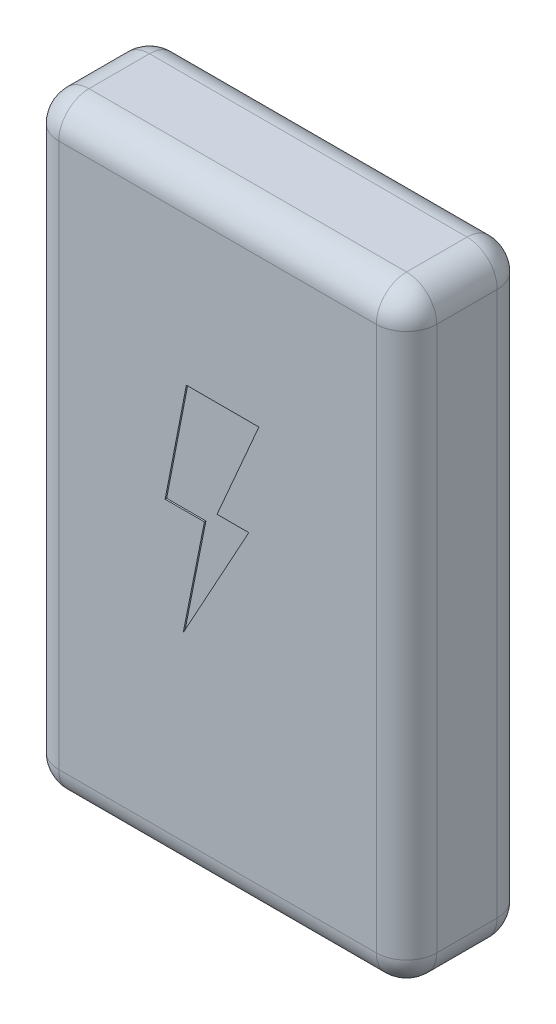
ISO-10303-21;
HEADER;
FILE_DESCRIPTION(('STEP AP214'),'2;1');
FILE_NAME('part.step','',(''),(''),'','','');
FILE_SCHEMA(('AUTOMOTIVE_DESIGN { 1 0 10303 214 1 1 1 1 }'));
ENDSEC;
DATA;
#1=APPLICATION_CONTEXT('core data for automotive mechanical design processes');
#2=APPLICATION_PROTOCOL_DEFINITION('international standard','automotive_design',2000,#1);
#3=PRODUCT_CONTEXT('',#1,'mechanical');
#4=PRODUCT('Part','Part','',(#3));
#5=PRODUCT_RELATED_PRODUCT_CATEGORY('part','',(#4));
#6=PRODUCT_DEFINITION_FORMATION('','',#4);
#7=PRODUCT_DEFINITION_CONTEXT('part definition',#1,'design');
#8=PRODUCT_DEFINITION('design','',#6,#7);
#9=PRODUCT_DEFINITION_SHAPE('','',#8);
#10=(LENGTH_UNIT() NAMED_UNIT(*) SI_UNIT(.MILLI.,.METRE.));
#11=(NAMED_UNIT(*) PLANE_ANGLE_UNIT() SI_UNIT($,.RADIAN.));
#12=(NAMED_UNIT(*) SI_UNIT($,.STERADIAN.) SOLID_ANGLE_UNIT());
#13=UNCERTAINTY_MEASURE_WITH_UNIT(LENGTH_MEASURE(1.E-05),#10,'distance_accuracy_value','');
#14=(GEOMETRIC_REPRESENTATION_CONTEXT(3) GLOBAL_UNCERTAINTY_ASSIGNED_CONTEXT((#13)) GLOBAL_UNIT_ASSIGNED_CONTEXT((#10,
#11,#12)) REPRESENTATION_CONTEXT('',''));
#15=CARTESIAN_POINT('',(0.,0.,0.));
#16=DIRECTION('',(0.,0.,1.));
#17=DIRECTION('',(1.,0.,0.));
#18=AXIS2_PLACEMENT_3D('',#15,#16,#17);
#19=CARTESIAN_POINT('',(12.5,-20.,8.));
#20=DIRECTION('',(-1.,0.,0.));
#21=DIRECTION('',(0.,0.,1.));
#22=AXIS2_PLACEMENT_3D('',#19,#20,#21);
#23=PLANE('',#22);
#24=DIRECTION('',(0.,1.,0.));
#25=VECTOR('',#24,1.);
#26=CARTESIAN_POINT('',(12.5,-20.,6.));
#27=LINE('',#26,#25);
#28=CARTESIAN_POINT('',(12.5,18.,6.));
#29=VERTEX_POINT('',#28);
#30=CARTESIAN_POINT('',(12.5,-18.,6.));
#31=VERTEX_POINT('',#30);
#32=EDGE_CURVE('E232',#29,#31,#27,.F.);
#33=ORIENTED_EDGE('',*,*,#32,.T.);
#34=DIRECTION('',(0.,0.,-1.));
#35=VECTOR('',#34,1.);
#36=CARTESIAN_POINT('',(12.5,-18.,8.));
#37=LINE('',#36,#35);
#38=CARTESIAN_POINT('',(12.5,-18.,2.));
#39=VERTEX_POINT('',#38);
#40=EDGE_CURVE('E237',#31,#39,#37,.T.);
#41=ORIENTED_EDGE('',*,*,#40,.T.);
#42=DIRECTION('',(0.,1.,0.));
#43=VECTOR('',#42,1.);
#44=CARTESIAN_POINT('',(12.5,20.,2.));
#45=LINE('',#44,#43);
#46=CARTESIAN_POINT('',(12.5,18.,2.));
#47=VERTEX_POINT('',#46);
#48=EDGE_CURVE('E234',#39,#47,#45,.T.);
#49=ORIENTED_EDGE('',*,*,#48,.T.);
#50=DIRECTION('',(0.,0.,-1.));
#51=VECTOR('',#50,1.);
#52=CARTESIAN_POINT('',(12.5,18.,8.));
#53=LINE('',#52,#51);
#54=EDGE_CURVE('E230',#47,#29,#53,.F.);
#55=ORIENTED_EDGE('',*,*,#54,.T.);
#56=EDGE_LOOP('',(#33,#41,#49,#55));
#57=FACE_BOUND('',#56,.T.);
#58=ADVANCED_FACE('F35',(#57),#23,.F.);
#59=CARTESIAN_POINT('',(-12.5,20.,8.));
#60=DIRECTION('',(0.,-1.,0.));
#61=DIRECTION('',(0.,0.,-1.));
#62=AXIS2_PLACEMENT_3D('',#59,#60,#61);
#63=PLANE('',#62);
#64=DIRECTION('',(-1.,0.,0.));
#65=VECTOR('',#64,1.);
#66=CARTESIAN_POINT('',(-12.5,20.,6.));
#67=LINE('',#66,#65);
#68=CARTESIAN_POINT('',(-10.5,20.,6.));
#69=VERTEX_POINT('',#68);
#70=CARTESIAN_POINT('',(10.5,20.,6.));
#71=VERTEX_POINT('',#70);
#72=EDGE_CURVE('E44',#69,#71,#67,.F.);
#73=ORIENTED_EDGE('',*,*,#72,.T.);
#74=DIRECTION('',(0.,0.,-1.));
#75=VECTOR('',#74,1.);
#76=CARTESIAN_POINT('',(10.5,20.,8.));
#77=LINE('',#76,#75);
#78=CARTESIAN_POINT('',(10.5,20.,2.));
#79=VERTEX_POINT('',#78);
#80=EDGE_CURVE('E11',#71,#79,#77,.T.);
#81=ORIENTED_EDGE('',*,*,#80,.T.);
#82=DIRECTION('',(-1.,0.,0.));
#83=VECTOR('',#82,1.);
#84=CARTESIAN_POINT('',(-12.5,20.,2.));
#85=LINE('',#84,#83);
#86=CARTESIAN_POINT('',(-10.5,20.,2.));
#87=VERTEX_POINT('',#86);
#88=EDGE_CURVE('E275',#79,#87,#85,.T.);
#89=ORIENTED_EDGE('',*,*,#88,.T.);
#90=DIRECTION('',(0.,0.,-1.));
#91=VECTOR('',#90,1.);
#92=CARTESIAN_POINT('',(-10.5,20.,8.));
#93=LINE('',#92,#91);
#94=EDGE_CURVE('E277',#87,#69,#93,.F.);
#95=ORIENTED_EDGE('',*,*,#94,.T.);
#96=EDGE_LOOP('',(#73,#81,#89,#95));
#97=FACE_BOUND('',#96,.T.);
#98=ADVANCED_FACE('F432',(#97),#63,.F.);
#99=CARTESIAN_POINT('',(-12.5,-20.,8.));
#100=DIRECTION('',(1.,0.,0.));
#101=DIRECTION('',(0.,0.,-1.));
#102=AXIS2_PLACEMENT_3D('',#99,#100,#101);
#103=PLANE('',#102);
#104=DIRECTION('',(0.,-1.,0.));
#105=VECTOR('',#104,1.);
#106=CARTESIAN_POINT('',(-12.5,-20.,2.));
#107=LINE('',#106,#105);
#108=CARTESIAN_POINT('',(-12.5,18.,2.));
#109=VERTEX_POINT('',#108);
#110=CARTESIAN_POINT('',(-12.5,-18.,2.));
#111=VERTEX_POINT('',#110);
#112=EDGE_CURVE('E259',#109,#111,#107,.T.);
#113=ORIENTED_EDGE('',*,*,#112,.T.);
#114=DIRECTION('',(0.,0.,-1.));
#115=VECTOR('',#114,1.);
#116=CARTESIAN_POINT('',(-12.5,-18.,8.));
#117=LINE('',#116,#115);
#118=CARTESIAN_POINT('',(-12.5,-18.,6.));
#119=VERTEX_POINT('',#118);
#120=EDGE_CURVE('E264',#111,#119,#117,.F.);
#121=ORIENTED_EDGE('',*,*,#120,.T.);
#122=DIRECTION('',(0.,-1.,0.));
#123=VECTOR('',#122,1.);
#124=CARTESIAN_POINT('',(-12.5,-20.,6.));
#125=LINE('',#124,#123);
#126=CARTESIAN_POINT('',(-12.5,18.,6.));
#127=VERTEX_POINT('',#126);
#128=EDGE_CURVE('E261',#119,#127,#125,.F.);
#129=ORIENTED_EDGE('',*,*,#128,.T.);
#130=DIRECTION('',(0.,0.,-1.));
#131=VECTOR('',#130,1.);
#132=CARTESIAN_POINT('',(-12.5,18.,8.));
#133=LINE('',#132,#131);
#134=EDGE_CURVE('E257',#127,#109,#133,.T.);
#135=ORIENTED_EDGE('',*,*,#134,.T.);
#136=EDGE_LOOP('',(#113,#121,#129,#135));
#137=FACE_BOUND('',#136,.T.);
#138=ADVANCED_FACE('F384',(#137),#103,.F.);
#139=CARTESIAN_POINT('',(-12.5,-20.,8.));
#140=DIRECTION('',(0.,1.,0.));
#141=DIRECTION('',(0.,0.,1.));
#142=AXIS2_PLACEMENT_3D('',#139,#140,#141);
#143=PLANE('',#142);
#144=DIRECTION('',(1.,0.,0.));
#145=VECTOR('',#144,1.);
#146=CARTESIAN_POINT('',(-12.5,-20.,6.));
#147=LINE('',#146,#145);
#148=CARTESIAN_POINT('',(10.5,-20.,6.));
#149=VERTEX_POINT('',#148);
#150=CARTESIAN_POINT('',(-10.5,-20.,6.));
#151=VERTEX_POINT('',#150);
#152=EDGE_CURVE('E270',#149,#151,#147,.F.);
#153=ORIENTED_EDGE('',*,*,#152,.T.);
#154=DIRECTION('',(0.,0.,-1.));
#155=VECTOR('',#154,1.);
#156=CARTESIAN_POINT('',(-10.5,-20.,8.));
#157=LINE('',#156,#155);
#158=CARTESIAN_POINT('',(-10.5,-20.,2.));
#159=VERTEX_POINT('',#158);
#160=EDGE_CURVE('E272',#151,#159,#157,.T.);
#161=ORIENTED_EDGE('',*,*,#160,.T.);
#162=DIRECTION('',(1.,0.,0.));
#163=VECTOR('',#162,1.);
#164=CARTESIAN_POINT('',(12.5,-20.,2.));
#165=LINE('',#164,#163);
#166=CARTESIAN_POINT('',(10.5,-20.,2.));
#167=VERTEX_POINT('',#166);
#168=EDGE_CURVE('E266',#159,#167,#165,.T.);
#169=ORIENTED_EDGE('',*,*,#168,.T.);
#170=DIRECTION('',(0.,0.,-1.));
#171=VECTOR('',#170,1.);
#172=CARTESIAN_POINT('',(10.5,-20.,8.));
#173=LINE('',#172,#171);
#174=EDGE_CURVE('E268',#167,#149,#173,.F.);
#175=ORIENTED_EDGE('',*,*,#174,.T.);
#176=EDGE_LOOP('',(#153,#161,#169,#175));
#177=FACE_BOUND('',#176,.T.);
#178=ADVANCED_FACE('F363',(#177),#143,.F.);
#179=CARTESIAN_POINT('',(0.,0.,8.));
#180=DIRECTION('',(0.,0.,-1.));
#181=DIRECTION('',(-1.,0.,0.));
#182=AXIS2_PLACEMENT_3D('',#179,#180,#181);
#183=PLANE('',#182);
#184=DIRECTION('',(1.,0.,0.));
#185=VECTOR('',#184,1.);
#186=CARTESIAN_POINT('',(-0.867604628289784,1.00308288129449,8.));
#187=LINE('',#186,#185);
#188=CARTESIAN_POINT('',(-3.46430276113144,1.00308288129449,8.));
#189=VERTEX_POINT('',#188);
#190=CARTESIAN_POINT('',(-0.867604628289784,1.00308288129449,8.));
#191=VERTEX_POINT('',#190);
#192=EDGE_CURVE('E205',#189,#191,#187,.T.);
#193=ORIENTED_EDGE('',*,*,#192,.F.);
#194=DIRECTION('',(-0.190425341389638,-0.981701680428754,0.));
#195=VECTOR('',#194,1.);
#196=CARTESIAN_POINT('',(-3.46430276113144,1.00308288129449,8.));
#197=LINE('',#196,#195);
#198=CARTESIAN_POINT('',(-2.06102047070228,8.23743820699371,8.));
#199=VERTEX_POINT('',#198);
#200=EDGE_CURVE('E52',#199,#189,#197,.T.);
#201=ORIENTED_EDGE('',*,*,#200,.F.);
#202=DIRECTION('',(-1.,0.,0.));
#203=VECTOR('',#202,1.);
#204=CARTESIAN_POINT('',(-2.06102047070228,8.23743820699371,8.));
#205=LINE('',#204,#203);
#206=CARTESIAN_POINT('',(2.73657323232504,8.23743820699371,8.));
#207=VERTEX_POINT('',#206);
#208=EDGE_CURVE('E188',#207,#199,#205,.T.);
#209=ORIENTED_EDGE('',*,*,#208,.F.);
#210=DIRECTION('',(0.397890513057752,0.917432907420831,0.));
#211=VECTOR('',#210,1.);
#212=CARTESIAN_POINT('',(2.73657323232504,8.23743820699371,8.));
#213=LINE('',#212,#211);
#214=CARTESIAN_POINT('',(-0.0318433643303729,1.85418350784734,8.));
#215=VERTEX_POINT('',#214);
#216=EDGE_CURVE('E191',#215,#207,#213,.T.);
#217=ORIENTED_EDGE('',*,*,#216,.F.);
#218=DIRECTION('',(-1.,0.,0.));
#219=VECTOR('',#218,1.);
#220=CARTESIAN_POINT('',(-0.0318433643303729,1.85418350784734,8.));
#221=LINE('',#220,#219);
#222=CARTESIAN_POINT('',(2.06818064833672,1.85418350784734,8.));
#223=VERTEX_POINT('',#222);
#224=EDGE_CURVE('E213',#223,#215,#221,.T.);
#225=ORIENTED_EDGE('',*,*,#224,.F.);
#226=DIRECTION('',(0.481485492555053,0.876454060666626,0.));
#227=VECTOR('',#226,1.);
#228=CARTESIAN_POINT('',(2.06818064833672,1.85418350784734,8.));
#229=LINE('',#228,#227);
#230=CARTESIAN_POINT('',(-2.26838238290328,-6.03971638495679,8.));
#231=VERTEX_POINT('',#230);
#232=EDGE_CURVE('E210',#231,#223,#229,.T.);
#233=ORIENTED_EDGE('',*,*,#232,.F.);
#234=DIRECTION('',(-0.195073962632189,-0.980788534345185,0.));
#235=VECTOR('',#234,1.);
#236=CARTESIAN_POINT('',(-2.26838238290328,-6.03971638495679,8.));
#237=LINE('',#236,#235);
#238=EDGE_CURVE('E207',#191,#231,#237,.T.);
#239=ORIENTED_EDGE('',*,*,#238,.F.);
#240=EDGE_LOOP('',(#193,#201,#209,#217,#225,#233,#239));
#241=FACE_BOUND('',#240,.T.);
#242=DIRECTION('',(0.,-1.,0.));
#243=VECTOR('',#242,1.);
#244=CARTESIAN_POINT('',(-10.5,0.,8.));
#245=LINE('',#244,#243);
#246=CARTESIAN_POINT('',(-10.5,18.,8.));
#247=VERTEX_POINT('',#246);
#248=CARTESIAN_POINT('',(-10.5,-18.,8.));
#249=VERTEX_POINT('',#248);
#250=EDGE_CURVE('E250',#247,#249,#245,.T.);
#251=ORIENTED_EDGE('',*,*,#250,.T.);
#252=DIRECTION('',(1.,0.,0.));
#253=VECTOR('',#252,1.);
#254=CARTESIAN_POINT('',(0.,-18.,8.));
#255=LINE('',#254,#253);
#256=CARTESIAN_POINT('',(10.5,-18.,8.));
#257=VERTEX_POINT('',#256);
#258=EDGE_CURVE('E255',#249,#257,#255,.T.);
#259=ORIENTED_EDGE('',*,*,#258,.T.);
#260=DIRECTION('',(0.,1.,0.));
#261=VECTOR('',#260,1.);
#262=CARTESIAN_POINT('',(10.5,0.,8.));
#263=LINE('',#262,#261);
#264=CARTESIAN_POINT('',(10.5,18.,8.));
#265=VERTEX_POINT('',#264);
#266=EDGE_CURVE('E252',#257,#265,#263,.T.);
#267=ORIENTED_EDGE('',*,*,#266,.T.);
#268=DIRECTION('',(-1.,0.,0.));
#269=VECTOR('',#268,1.);
#270=CARTESIAN_POINT('',(0.,18.,8.));
#271=LINE('',#270,#269);
#272=EDGE_CURVE('E248',#265,#247,#271,.T.);
#273=ORIENTED_EDGE('',*,*,#272,.T.);
#274=EDGE_LOOP('',(#251,#259,#267,#273));
#275=FACE_BOUND('',#274,.T.);
#276=ADVANCED_FACE('F371',(#241,#275),#183,.F.);
#277=CARTESIAN_POINT('',(0.,0.,0.));
#278=DIRECTION('',(0.,0.,-1.));
#279=DIRECTION('',(-1.,0.,0.));
#280=AXIS2_PLACEMENT_3D('',#277,#278,#279);
#281=PLANE('',#280);
#282=DIRECTION('',(0.,1.,0.));
#283=VECTOR('',#282,1.);
#284=CARTESIAN_POINT('',(10.5,-20.,0.));
#285=LINE('',#284,#283);
#286=CARTESIAN_POINT('',(10.5,18.,0.));
#287=VERTEX_POINT('',#286);
#288=CARTESIAN_POINT('',(10.5,-18.,0.));
#289=VERTEX_POINT('',#288);
#290=EDGE_CURVE('E243',#287,#289,#285,.F.);
#291=ORIENTED_EDGE('',*,*,#290,.T.);
#292=DIRECTION('',(1.,0.,0.));
#293=VECTOR('',#292,1.);
#294=CARTESIAN_POINT('',(-12.5,-18.,0.));
#295=LINE('',#294,#293);
#296=CARTESIAN_POINT('',(-10.5,-18.,0.));
#297=VERTEX_POINT('',#296);
#298=EDGE_CURVE('E246',#289,#297,#295,.F.);
#299=ORIENTED_EDGE('',*,*,#298,.T.);
#300=DIRECTION('',(0.,-1.,0.));
#301=VECTOR('',#300,1.);
#302=CARTESIAN_POINT('',(-10.5,20.,0.));
#303=LINE('',#302,#301);
#304=CARTESIAN_POINT('',(-10.5,18.,0.));
#305=VERTEX_POINT('',#304);
#306=EDGE_CURVE('E241',#297,#305,#303,.F.);
#307=ORIENTED_EDGE('',*,*,#306,.T.);
#308=DIRECTION('',(-1.,0.,0.));
#309=VECTOR('',#308,1.);
#310=CARTESIAN_POINT('',(12.5,18.,0.));
#311=LINE('',#310,#309);
#312=EDGE_CURVE('E239',#305,#287,#311,.F.);
#313=ORIENTED_EDGE('',*,*,#312,.T.);
#314=EDGE_LOOP('',(#291,#299,#307,#313));
#315=FACE_BOUND('',#314,.T.);
#316=ADVANCED_FACE('F404',(#315),#281,.T.);
#317=CARTESIAN_POINT('',(-10.5,0.,6.));
#318=DIRECTION('',(0.,-1.,0.));
#319=DIRECTION('',(0.,0.,-1.));
#320=AXIS2_PLACEMENT_3D('',#317,#318,#319);
#321=CYLINDRICAL_SURFACE('',#320,2.);
#322=CARTESIAN_POINT('',(-10.5,-18.,6.));
#323=DIRECTION('',(0.,-1.,0.));
#324=DIRECTION('',(0.,0.,-1.));
#325=AXIS2_PLACEMENT_3D('',#322,#323,#324);
#326=CIRCLE('',#325,2.);
#327=EDGE_CURVE('E39',#249,#119,#326,.T.);
#328=ORIENTED_EDGE('',*,*,#327,.F.);
#329=ORIENTED_EDGE('',*,*,#250,.F.);
#330=CARTESIAN_POINT('',(-10.5,18.,6.));
#331=DIRECTION('',(0.,1.,0.));
#332=DIRECTION('',(0.,0.,1.));
#333=AXIS2_PLACEMENT_3D('',#330,#331,#332);
#334=CIRCLE('',#333,2.);
#335=EDGE_CURVE('E340',#127,#247,#334,.T.);
#336=ORIENTED_EDGE('',*,*,#335,.F.);
#337=ORIENTED_EDGE('',*,*,#128,.F.);
#338=EDGE_LOOP('',(#328,#329,#336,#337));
#339=FACE_BOUND('',#338,.T.);
#340=ADVANCED_FACE('F37',(#339),#321,.T.);
#341=CARTESIAN_POINT('',(-10.5,-18.,6.));
#342=DIRECTION('',(0.,0.,1.));
#343=DIRECTION('',(1.,0.,0.));
#344=AXIS2_PLACEMENT_3D('',#341,#342,#343);
#345=SPHERICAL_SURFACE('',#344,2.);
#346=CARTESIAN_POINT('',(-10.5,-18.,6.));
#347=DIRECTION('',(-1.,0.,0.));
#348=DIRECTION('',(0.,0.,1.));
#349=AXIS2_PLACEMENT_3D('',#346,#347,#348);
#350=CIRCLE('',#349,2.);
#351=EDGE_CURVE('E335',#249,#151,#350,.F.);
#352=ORIENTED_EDGE('',*,*,#351,.F.);
#353=ORIENTED_EDGE('',*,*,#327,.T.);
#354=CARTESIAN_POINT('',(-10.5,-18.,6.));
#355=DIRECTION('',(0.,0.,1.));
#356=DIRECTION('',(1.,0.,0.));
#357=AXIS2_PLACEMENT_3D('',#354,#355,#356);
#358=CIRCLE('',#357,2.);
#359=EDGE_CURVE('E338',#151,#119,#358,.F.);
#360=ORIENTED_EDGE('',*,*,#359,.F.);
#361=EDGE_LOOP('',(#352,#353,#360));
#362=FACE_BOUND('',#361,.T.);
#363=ADVANCED_FACE('F351',(#362),#345,.T.);
#364=CARTESIAN_POINT('',(-10.5,18.,6.));
#365=DIRECTION('',(0.,0.,1.));
#366=DIRECTION('',(1.,0.,0.));
#367=AXIS2_PLACEMENT_3D('',#364,#365,#366);
#368=SPHERICAL_SURFACE('',#367,2.);
#369=CARTESIAN_POINT('',(-10.5,18.,6.));
#370=DIRECTION('',(0.,0.,1.));
#371=DIRECTION('',(1.,0.,0.));
#372=AXIS2_PLACEMENT_3D('',#369,#370,#371);
#373=CIRCLE('',#372,2.);
#374=EDGE_CURVE('E329',#127,#69,#373,.F.);
#375=ORIENTED_EDGE('',*,*,#374,.F.);
#376=ORIENTED_EDGE('',*,*,#335,.T.);
#377=CARTESIAN_POINT('',(-10.5,18.,6.));
#378=DIRECTION('',(-1.,0.,0.));
#379=DIRECTION('',(0.,0.,1.));
#380=AXIS2_PLACEMENT_3D('',#377,#378,#379);
#381=CIRCLE('',#380,2.);
#382=EDGE_CURVE('E332',#69,#247,#381,.F.);
#383=ORIENTED_EDGE('',*,*,#382,.F.);
#384=EDGE_LOOP('',(#375,#376,#383));
#385=FACE_BOUND('',#384,.T.);
#386=ADVANCED_FACE('F597',(#385),#368,.T.);
#387=CARTESIAN_POINT('',(-10.5,-18.,8.));
#388=DIRECTION('',(0.,0.,-1.));
#389=DIRECTION('',(-1.,0.,0.));
#390=AXIS2_PLACEMENT_3D('',#387,#388,#389);
#391=CYLINDRICAL_SURFACE('',#390,2.);
#392=ORIENTED_EDGE('',*,*,#359,.T.);
#393=ORIENTED_EDGE('',*,*,#120,.F.);
#394=CARTESIAN_POINT('',(-10.5,-18.,2.));
#395=DIRECTION('',(0.,0.,-1.));
#396=DIRECTION('',(-1.,0.,0.));
#397=AXIS2_PLACEMENT_3D('',#394,#395,#396);
#398=CIRCLE('',#397,2.);
#399=EDGE_CURVE('E323',#159,#111,#398,.T.);
#400=ORIENTED_EDGE('',*,*,#399,.F.);
#401=ORIENTED_EDGE('',*,*,#160,.F.);
#402=EDGE_LOOP('',(#392,#393,#400,#401));
#403=FACE_BOUND('',#402,.T.);
#404=ADVANCED_FACE('F359',(#403),#391,.T.);
#405=CARTESIAN_POINT('',(0.,-18.,6.));
#406=DIRECTION('',(1.,0.,0.));
#407=DIRECTION('',(0.,0.,-1.));
#408=AXIS2_PLACEMENT_3D('',#405,#406,#407);
#409=CYLINDRICAL_SURFACE('',#408,2.);
#410=ORIENTED_EDGE('',*,*,#351,.T.);
#411=ORIENTED_EDGE('',*,*,#152,.F.);
#412=CARTESIAN_POINT('',(10.5,-18.,6.));
#413=DIRECTION('',(1.,0.,0.));
#414=DIRECTION('',(0.,0.,-1.));
#415=AXIS2_PLACEMENT_3D('',#412,#413,#414);
#416=CIRCLE('',#415,2.);
#417=EDGE_CURVE('E320',#257,#149,#416,.T.);
#418=ORIENTED_EDGE('',*,*,#417,.F.);
#419=ORIENTED_EDGE('',*,*,#258,.F.);
#420=EDGE_LOOP('',(#410,#411,#418,#419));
#421=FACE_BOUND('',#420,.T.);
#422=ADVANCED_FACE('F368',(#421),#409,.T.);
#423=CARTESIAN_POINT('',(10.5,0.,6.));
#424=DIRECTION('',(0.,1.,0.));
#425=DIRECTION('',(0.,0.,1.));
#426=AXIS2_PLACEMENT_3D('',#423,#424,#425);
#427=CYLINDRICAL_SURFACE('',#426,2.);
#428=CARTESIAN_POINT('',(10.5,18.,6.));
#429=DIRECTION('',(0.,1.,0.));
#430=DIRECTION('',(0.,0.,1.));
#431=AXIS2_PLACEMENT_3D('',#428,#429,#430);
#432=CIRCLE('',#431,2.);
#433=EDGE_CURVE('E314',#265,#29,#432,.T.);
#434=ORIENTED_EDGE('',*,*,#433,.F.);
#435=ORIENTED_EDGE('',*,*,#266,.F.);
#436=CARTESIAN_POINT('',(10.5,-18.,6.));
#437=DIRECTION('',(0.,-1.,0.));
#438=DIRECTION('',(0.,0.,-1.));
#439=AXIS2_PLACEMENT_3D('',#436,#437,#438);
#440=CIRCLE('',#439,2.);
#441=EDGE_CURVE('E317',#31,#257,#440,.T.);
#442=ORIENTED_EDGE('',*,*,#441,.F.);
#443=ORIENTED_EDGE('',*,*,#32,.F.);
#444=EDGE_LOOP('',(#434,#435,#442,#443));
#445=FACE_BOUND('',#444,.T.);
#446=ADVANCED_FACE('F375',(#445),#427,.T.);
#447=CARTESIAN_POINT('',(0.,18.,6.));
#448=DIRECTION('',(-1.,0.,0.));
#449=DIRECTION('',(0.,0.,1.));
#450=AXIS2_PLACEMENT_3D('',#447,#448,#449);
#451=CYLINDRICAL_SURFACE('',#450,2.);
#452=ORIENTED_EDGE('',*,*,#382,.T.);
#453=ORIENTED_EDGE('',*,*,#272,.F.);
#454=CARTESIAN_POINT('',(10.5,18.,6.));
#455=DIRECTION('',(1.,0.,0.));
#456=DIRECTION('',(0.,0.,-1.));
#457=AXIS2_PLACEMENT_3D('',#454,#455,#456);
#458=CIRCLE('',#457,2.);
#459=EDGE_CURVE('E312',#71,#265,#458,.T.);
#460=ORIENTED_EDGE('',*,*,#459,.F.);
#461=ORIENTED_EDGE('',*,*,#72,.F.);
#462=EDGE_LOOP('',(#452,#453,#460,#461));
#463=FACE_BOUND('',#462,.T.);
#464=ADVANCED_FACE('F382',(#463),#451,.T.);
#465=CARTESIAN_POINT('',(-10.5,18.,8.));
#466=DIRECTION('',(0.,0.,-1.));
#467=DIRECTION('',(-1.,0.,0.));
#468=AXIS2_PLACEMENT_3D('',#465,#466,#467);
#469=CYLINDRICAL_SURFACE('',#468,2.);
#470=ORIENTED_EDGE('',*,*,#374,.T.);
#471=ORIENTED_EDGE('',*,*,#94,.F.);
#472=CARTESIAN_POINT('',(-10.5,18.,2.));
#473=DIRECTION('',(0.,0.,-1.));
#474=DIRECTION('',(-1.,0.,0.));
#475=AXIS2_PLACEMENT_3D('',#472,#473,#474);
#476=CIRCLE('',#475,2.);
#477=EDGE_CURVE('E309',#109,#87,#476,.T.);
#478=ORIENTED_EDGE('',*,*,#477,.F.);
#479=ORIENTED_EDGE('',*,*,#134,.F.);
#480=EDGE_LOOP('',(#470,#471,#478,#479));
#481=FACE_BOUND('',#480,.T.);
#482=ADVANCED_FACE('F394',(#481),#469,.T.);
#483=CARTESIAN_POINT('',(-10.5,-20.,2.));
#484=DIRECTION('',(0.,1.,0.));
#485=DIRECTION('',(0.,0.,1.));
#486=AXIS2_PLACEMENT_3D('',#483,#484,#485);
#487=CYLINDRICAL_SURFACE('',#486,2.);
#488=CARTESIAN_POINT('',(-10.5,-18.,2.));
#489=DIRECTION('',(0.,-1.,0.));
#490=DIRECTION('',(0.,0.,-1.));
#491=AXIS2_PLACEMENT_3D('',#488,#489,#490);
#492=CIRCLE('',#491,2.);
#493=EDGE_CURVE('E326',#111,#297,#492,.T.);
#494=ORIENTED_EDGE('',*,*,#493,.F.);
#495=ORIENTED_EDGE('',*,*,#112,.F.);
#496=CARTESIAN_POINT('',(-10.5,18.,2.));
#497=DIRECTION('',(0.,1.,0.));
#498=DIRECTION('',(-1.,0.,0.));
#499=AXIS2_PLACEMENT_3D('',#496,#497,#498);
#500=CIRCLE('',#499,2.);
#501=EDGE_CURVE('E306',#305,#109,#500,.T.);
#502=ORIENTED_EDGE('',*,*,#501,.F.);
#503=ORIENTED_EDGE('',*,*,#306,.F.);
#504=EDGE_LOOP('',(#494,#495,#502,#503));
#505=FACE_BOUND('',#504,.T.);
#506=ADVANCED_FACE('F389',(#505),#487,.T.);
#507=CARTESIAN_POINT('',(-10.5,-18.,2.));
#508=DIRECTION('',(0.,0.,1.));
#509=DIRECTION('',(1.,0.,0.));
#510=AXIS2_PLACEMENT_3D('',#507,#508,#509);
#511=SPHERICAL_SURFACE('',#510,2.);
#512=ORIENTED_EDGE('',*,*,#399,.T.);
#513=ORIENTED_EDGE('',*,*,#493,.T.);
#514=CARTESIAN_POINT('',(-10.5,-18.,2.));
#515=DIRECTION('',(-1.,0.,0.));
#516=DIRECTION('',(0.,0.,1.));
#517=AXIS2_PLACEMENT_3D('',#514,#515,#516);
#518=CIRCLE('',#517,2.);
#519=EDGE_CURVE('E303',#159,#297,#518,.F.);
#520=ORIENTED_EDGE('',*,*,#519,.F.);
#521=EDGE_LOOP('',(#512,#513,#520));
#522=FACE_BOUND('',#521,.T.);
#523=ADVANCED_FACE('F408',(#522),#511,.T.);
#524=CARTESIAN_POINT('',(10.5,-18.,6.));
#525=DIRECTION('',(0.,0.,1.));
#526=DIRECTION('',(1.,0.,0.));
#527=AXIS2_PLACEMENT_3D('',#524,#525,#526);
#528=SPHERICAL_SURFACE('',#527,2.);
#529=ORIENTED_EDGE('',*,*,#441,.T.);
#530=ORIENTED_EDGE('',*,*,#417,.T.);
#531=CARTESIAN_POINT('',(10.5,-18.,6.));
#532=DIRECTION('',(0.,0.,1.));
#533=DIRECTION('',(1.,0.,0.));
#534=AXIS2_PLACEMENT_3D('',#531,#532,#533);
#535=CIRCLE('',#534,2.);
#536=EDGE_CURVE('E300',#31,#149,#535,.F.);
#537=ORIENTED_EDGE('',*,*,#536,.F.);
#538=EDGE_LOOP('',(#529,#530,#537));
#539=FACE_BOUND('',#538,.T.);
#540=ADVANCED_FACE('F421',(#539),#528,.T.);
#541=CARTESIAN_POINT('',(10.5,18.,6.));
#542=DIRECTION('',(0.,0.,1.));
#543=DIRECTION('',(1.,0.,0.));
#544=AXIS2_PLACEMENT_3D('',#541,#542,#543);
#545=SPHERICAL_SURFACE('',#544,2.);
#546=ORIENTED_EDGE('',*,*,#459,.T.);
#547=ORIENTED_EDGE('',*,*,#433,.T.);
#548=CARTESIAN_POINT('',(10.5,18.,6.));
#549=DIRECTION('',(0.,0.,1.));
#550=DIRECTION('',(1.,0.,0.));
#551=AXIS2_PLACEMENT_3D('',#548,#549,#550);
#552=CIRCLE('',#551,2.);
#553=EDGE_CURVE('E297',#71,#29,#552,.F.);
#554=ORIENTED_EDGE('',*,*,#553,.F.);
#555=EDGE_LOOP('',(#546,#547,#554));
#556=FACE_BOUND('',#555,.T.);
#557=ADVANCED_FACE('F423',(#556),#545,.T.);
#558=CARTESIAN_POINT('',(-10.5,18.,2.));
#559=DIRECTION('',(0.,0.,1.));
#560=DIRECTION('',(1.,0.,0.));
#561=AXIS2_PLACEMENT_3D('',#558,#559,#560);
#562=SPHERICAL_SURFACE('',#561,2.);
#563=ORIENTED_EDGE('',*,*,#501,.T.);
#564=ORIENTED_EDGE('',*,*,#477,.T.);
#565=CARTESIAN_POINT('',(-10.5,18.,2.));
#566=DIRECTION('',(-1.,0.,0.));
#567=DIRECTION('',(0.,0.,1.));
#568=AXIS2_PLACEMENT_3D('',#565,#566,#567);
#569=CIRCLE('',#568,2.);
#570=EDGE_CURVE('E294',#305,#87,#569,.F.);
#571=ORIENTED_EDGE('',*,*,#570,.F.);
#572=EDGE_LOOP('',(#563,#564,#571));
#573=FACE_BOUND('',#572,.T.);
#574=ADVANCED_FACE('F396',(#573),#562,.T.);
#575=CARTESIAN_POINT('',(-12.5,-18.,2.));
#576=DIRECTION('',(-1.,0.,0.));
#577=DIRECTION('',(0.,0.,1.));
#578=AXIS2_PLACEMENT_3D('',#575,#576,#577);
#579=CYLINDRICAL_SURFACE('',#578,2.);
#580=ORIENTED_EDGE('',*,*,#519,.T.);
#581=ORIENTED_EDGE('',*,*,#298,.F.);
#582=CARTESIAN_POINT('',(10.5,-18.,2.));
#583=DIRECTION('',(1.,0.,0.));
#584=DIRECTION('',(0.,0.,-1.));
#585=AXIS2_PLACEMENT_3D('',#582,#583,#584);
#586=CIRCLE('',#585,2.);
#587=EDGE_CURVE('E291',#167,#289,#586,.T.);
#588=ORIENTED_EDGE('',*,*,#587,.F.);
#589=ORIENTED_EDGE('',*,*,#168,.F.);
#590=EDGE_LOOP('',(#580,#581,#588,#589));
#591=FACE_BOUND('',#590,.T.);
#592=ADVANCED_FACE('F410',(#591),#579,.T.);
#593=CARTESIAN_POINT('',(10.5,-18.,8.));
#594=DIRECTION('',(0.,0.,-1.));
#595=DIRECTION('',(-1.,0.,0.));
#596=AXIS2_PLACEMENT_3D('',#593,#594,#595);
#597=CYLINDRICAL_SURFACE('',#596,2.);
#598=ORIENTED_EDGE('',*,*,#536,.T.);
#599=ORIENTED_EDGE('',*,*,#174,.F.);
#600=CARTESIAN_POINT('',(10.5,-18.,2.));
#601=DIRECTION('',(0.,0.,-1.));
#602=DIRECTION('',(-1.,0.,0.));
#603=AXIS2_PLACEMENT_3D('',#600,#601,#602);
#604=CIRCLE('',#603,2.);
#605=EDGE_CURVE('E288',#39,#167,#604,.T.);
#606=ORIENTED_EDGE('',*,*,#605,.F.);
#607=ORIENTED_EDGE('',*,*,#40,.F.);
#608=EDGE_LOOP('',(#598,#599,#606,#607));
#609=FACE_BOUND('',#608,.T.);
#610=ADVANCED_FACE('F419',(#609),#597,.T.);
#611=CARTESIAN_POINT('',(10.5,18.,8.));
#612=DIRECTION('',(0.,0.,-1.));
#613=DIRECTION('',(-1.,0.,0.));
#614=AXIS2_PLACEMENT_3D('',#611,#612,#613);
#615=CYLINDRICAL_SURFACE('',#614,2.);
#616=ORIENTED_EDGE('',*,*,#553,.T.);
#617=ORIENTED_EDGE('',*,*,#54,.F.);
#618=CARTESIAN_POINT('',(10.5,18.,2.));
#619=DIRECTION('',(0.,0.,-1.));
#620=DIRECTION('',(-1.,0.,0.));
#621=AXIS2_PLACEMENT_3D('',#618,#619,#620);
#622=CIRCLE('',#621,2.);
#623=EDGE_CURVE('E285',#79,#47,#622,.T.);
#624=ORIENTED_EDGE('',*,*,#623,.F.);
#625=ORIENTED_EDGE('',*,*,#80,.F.);
#626=EDGE_LOOP('',(#616,#617,#624,#625));
#627=FACE_BOUND('',#626,.T.);
#628=ADVANCED_FACE('F453',(#627),#615,.T.);
#629=CARTESIAN_POINT('',(-12.5,18.,2.));
#630=DIRECTION('',(1.,0.,0.));
#631=DIRECTION('',(0.,0.,-1.));
#632=AXIS2_PLACEMENT_3D('',#629,#630,#631);
#633=CYLINDRICAL_SURFACE('',#632,2.);
#634=ORIENTED_EDGE('',*,*,#570,.T.);
#635=ORIENTED_EDGE('',*,*,#88,.F.);
#636=CARTESIAN_POINT('',(10.5,18.,2.));
#637=DIRECTION('',(1.,0.,0.));
#638=DIRECTION('',(0.,1.,0.));
#639=AXIS2_PLACEMENT_3D('',#636,#637,#638);
#640=CIRCLE('',#639,2.);
#641=EDGE_CURVE('E283',#287,#79,#640,.T.);
#642=ORIENTED_EDGE('',*,*,#641,.F.);
#643=ORIENTED_EDGE('',*,*,#312,.F.);
#644=EDGE_LOOP('',(#634,#635,#642,#643));
#645=FACE_BOUND('',#644,.T.);
#646=ADVANCED_FACE('F401',(#645),#633,.T.);
#647=CARTESIAN_POINT('',(10.5,-18.,2.));
#648=DIRECTION('',(0.,0.,1.));
#649=DIRECTION('',(1.,0.,0.));
#650=AXIS2_PLACEMENT_3D('',#647,#648,#649);
#651=SPHERICAL_SURFACE('',#650,2.);
#652=ORIENTED_EDGE('',*,*,#605,.T.);
#653=ORIENTED_EDGE('',*,*,#587,.T.);
#654=CARTESIAN_POINT('',(10.5,-18.,2.));
#655=DIRECTION('',(0.,-1.,0.));
#656=DIRECTION('',(0.,0.,-1.));
#657=AXIS2_PLACEMENT_3D('',#654,#655,#656);
#658=CIRCLE('',#657,2.);
#659=EDGE_CURVE('E281',#39,#289,#658,.F.);
#660=ORIENTED_EDGE('',*,*,#659,.F.);
#661=EDGE_LOOP('',(#652,#653,#660));
#662=FACE_BOUND('',#661,.T.);
#663=ADVANCED_FACE('F415',(#662),#651,.T.);
#664=CARTESIAN_POINT('',(10.5,18.,2.));
#665=DIRECTION('',(0.,0.,1.));
#666=DIRECTION('',(1.,0.,0.));
#667=AXIS2_PLACEMENT_3D('',#664,#665,#666);
#668=SPHERICAL_SURFACE('',#667,2.);
#669=ORIENTED_EDGE('',*,*,#641,.T.);
#670=ORIENTED_EDGE('',*,*,#623,.T.);
#671=CARTESIAN_POINT('',(10.5,18.,2.));
#672=DIRECTION('',(0.,1.,0.));
#673=DIRECTION('',(0.,0.,1.));
#674=AXIS2_PLACEMENT_3D('',#671,#672,#673);
#675=CIRCLE('',#674,2.);
#676=EDGE_CURVE('E220',#287,#47,#675,.F.);
#677=ORIENTED_EDGE('',*,*,#676,.F.);
#678=EDGE_LOOP('',(#669,#670,#677));
#679=FACE_BOUND('',#678,.T.);
#680=ADVANCED_FACE('F444',(#679),#668,.T.);
#681=CARTESIAN_POINT('',(10.5,-20.,2.));
#682=DIRECTION('',(0.,-1.,0.));
#683=DIRECTION('',(0.,0.,-1.));
#684=AXIS2_PLACEMENT_3D('',#681,#682,#683);
#685=CYLINDRICAL_SURFACE('',#684,2.);
#686=ORIENTED_EDGE('',*,*,#659,.T.);
#687=ORIENTED_EDGE('',*,*,#290,.F.);
#688=ORIENTED_EDGE('',*,*,#676,.T.);
#689=ORIENTED_EDGE('',*,*,#48,.F.);
#690=EDGE_LOOP('',(#686,#687,#688,#689));
#691=FACE_BOUND('',#690,.T.);
#692=ADVANCED_FACE('F441',(#691),#685,.T.);
#693=CARTESIAN_POINT('',(-3.46430276113144,1.00308288129449,7.9));
#694=DIRECTION('',(-0.981701680428754,0.190425341389638,0.));
#695=DIRECTION('',(-0.190425341389638,-0.981701680428754,0.));
#696=AXIS2_PLACEMENT_3D('',#693,#694,#695);
#697=PLANE('',#696);
#698=ORIENTED_EDGE('',*,*,#200,.T.);
#699=DIRECTION('',(0.,0.,1.));
#700=VECTOR('',#699,1.);
#701=CARTESIAN_POINT('',(-3.46430276113144,1.00308288129449,7.9));
#702=LINE('',#701,#700);
#703=CARTESIAN_POINT('',(-3.46430276113144,1.00308288129449,7.9));
#704=VERTEX_POINT('',#703);
#705=EDGE_CURVE('E165',#704,#189,#702,.T.);
#706=ORIENTED_EDGE('',*,*,#705,.F.);
#707=DIRECTION('',(-0.190425341389638,-0.981701680428754,0.));
#708=VECTOR('',#707,1.);
#709=CARTESIAN_POINT('',(-3.46430276113144,1.00308288129449,7.9));
#710=LINE('',#709,#708);
#711=CARTESIAN_POINT('',(-2.06102047070228,8.23743820699371,7.9));
#712=VERTEX_POINT('',#711);
#713=EDGE_CURVE('E169',#712,#704,#710,.T.);
#714=ORIENTED_EDGE('',*,*,#713,.F.);
#715=DIRECTION('',(0.,0.,1.));
#716=VECTOR('',#715,1.);
#717=CARTESIAN_POINT('',(-2.06102047070228,8.23743820699371,7.9));
#718=LINE('',#717,#716);
#719=EDGE_CURVE('E218',#712,#199,#718,.T.);
#720=ORIENTED_EDGE('',*,*,#719,.T.);
#721=EDGE_LOOP('',(#698,#706,#714,#720));
#722=FACE_BOUND('',#721,.T.);
#723=ADVANCED_FACE('F167',(#722),#697,.F.);
#724=CARTESIAN_POINT('',(-2.06102047070228,8.23743820699371,7.9));
#725=DIRECTION('',(0.,1.,0.));
#726=DIRECTION('',(0.,0.,1.));
#727=AXIS2_PLACEMENT_3D('',#724,#725,#726);
#728=PLANE('',#727);
#729=ORIENTED_EDGE('',*,*,#208,.T.);
#730=ORIENTED_EDGE('',*,*,#719,.F.);
#731=DIRECTION('',(-1.,0.,0.));
#732=VECTOR('',#731,1.);
#733=CARTESIAN_POINT('',(-2.06102047070228,8.23743820699371,7.9));
#734=LINE('',#733,#732);
#735=CARTESIAN_POINT('',(2.73657323232504,8.23743820699371,7.9));
#736=VERTEX_POINT('',#735);
#737=EDGE_CURVE('E175',#736,#712,#734,.T.);
#738=ORIENTED_EDGE('',*,*,#737,.F.);
#739=DIRECTION('',(0.,0.,1.));
#740=VECTOR('',#739,1.);
#741=CARTESIAN_POINT('',(2.73657323232504,8.23743820699371,7.9));
#742=LINE('',#741,#740);
#743=EDGE_CURVE('E221',#736,#207,#742,.T.);
#744=ORIENTED_EDGE('',*,*,#743,.T.);
#745=EDGE_LOOP('',(#729,#730,#738,#744));
#746=FACE_BOUND('',#745,.T.);
#747=ADVANCED_FACE('F501',(#746),#728,.F.);
#748=CARTESIAN_POINT('',(2.73657323232504,8.23743820699371,7.9));
#749=DIRECTION('',(0.917432907420831,-0.397890513057752,0.));
#750=DIRECTION('',(0.397890513057752,0.917432907420831,0.));
#751=AXIS2_PLACEMENT_3D('',#748,#749,#750);
#752=PLANE('',#751);
#753=ORIENTED_EDGE('',*,*,#216,.T.);
#754=ORIENTED_EDGE('',*,*,#743,.F.);
#755=DIRECTION('',(0.397890513057752,0.917432907420831,0.));
#756=VECTOR('',#755,1.);
#757=CARTESIAN_POINT('',(2.73657323232504,8.23743820699371,7.9));
#758=LINE('',#757,#756);
#759=CARTESIAN_POINT('',(-0.0318433643303729,1.85418350784734,7.9));
#760=VERTEX_POINT('',#759);
#761=EDGE_CURVE('E201',#760,#736,#758,.T.);
#762=ORIENTED_EDGE('',*,*,#761,.F.);
#763=DIRECTION('',(0.,0.,1.));
#764=VECTOR('',#763,1.);
#765=CARTESIAN_POINT('',(-0.0318433643303729,1.85418350784734,7.9));
#766=LINE('',#765,#764);
#767=EDGE_CURVE('E223',#760,#215,#766,.T.);
#768=ORIENTED_EDGE('',*,*,#767,.T.);
#769=EDGE_LOOP('',(#753,#754,#762,#768));
#770=FACE_BOUND('',#769,.T.);
#771=ADVANCED_FACE('F508',(#770),#752,.F.);
#772=CARTESIAN_POINT('',(-0.0318433643303729,1.85418350784734,7.9));
#773=DIRECTION('',(0.,1.,0.));
#774=DIRECTION('',(-1.,0.,0.));
#775=AXIS2_PLACEMENT_3D('',#772,#773,#774);
#776=PLANE('',#775);
#777=ORIENTED_EDGE('',*,*,#224,.T.);
#778=ORIENTED_EDGE('',*,*,#767,.F.);
#779=DIRECTION('',(-1.,0.,0.));
#780=VECTOR('',#779,1.);
#781=CARTESIAN_POINT('',(-0.0318433643303729,1.85418350784734,7.9));
#782=LINE('',#781,#780);
#783=CARTESIAN_POINT('',(2.06818064833672,1.85418350784734,7.9));
#784=VERTEX_POINT('',#783);
#785=EDGE_CURVE('E198',#784,#760,#782,.T.);
#786=ORIENTED_EDGE('',*,*,#785,.F.);
#787=DIRECTION('',(0.,0.,1.));
#788=VECTOR('',#787,1.);
#789=CARTESIAN_POINT('',(2.06818064833672,1.85418350784734,7.9));
#790=LINE('',#789,#788);
#791=EDGE_CURVE('E225',#784,#223,#790,.T.);
#792=ORIENTED_EDGE('',*,*,#791,.T.);
#793=EDGE_LOOP('',(#777,#778,#786,#792));
#794=FACE_BOUND('',#793,.T.);
#795=ADVANCED_FACE('F516',(#794),#776,.F.);
#796=CARTESIAN_POINT('',(2.06818064833672,1.85418350784734,7.9));
#797=DIRECTION('',(0.876454060666626,-0.481485492555053,0.));
#798=DIRECTION('',(0.481485492555053,0.876454060666626,0.));
#799=AXIS2_PLACEMENT_3D('',#796,#797,#798);
#800=PLANE('',#799);
#801=ORIENTED_EDGE('',*,*,#232,.T.);
#802=ORIENTED_EDGE('',*,*,#791,.F.);
#803=DIRECTION('',(0.481485492555053,0.876454060666626,0.));
#804=VECTOR('',#803,1.);
#805=CARTESIAN_POINT('',(2.06818064833672,1.85418350784734,7.9));
#806=LINE('',#805,#804);
#807=CARTESIAN_POINT('',(-2.26838238290328,-6.03971638495679,7.9));
#808=VERTEX_POINT('',#807);
#809=EDGE_CURVE('E195',#808,#784,#806,.T.);
#810=ORIENTED_EDGE('',*,*,#809,.F.);
#811=DIRECTION('',(0.,0.,1.));
#812=VECTOR('',#811,1.);
#813=CARTESIAN_POINT('',(-2.26838238290328,-6.03971638495679,7.9));
#814=LINE('',#813,#812);
#815=EDGE_CURVE('E227',#808,#231,#814,.T.);
#816=ORIENTED_EDGE('',*,*,#815,.T.);
#817=EDGE_LOOP('',(#801,#802,#810,#816));
#818=FACE_BOUND('',#817,.T.);
#819=ADVANCED_FACE('F524',(#818),#800,.F.);
#820=CARTESIAN_POINT('',(-2.26838238290328,-6.03971638495679,7.9));
#821=DIRECTION('',(-0.980788534345185,0.195073962632189,0.));
#822=DIRECTION('',(-0.195073962632189,-0.980788534345185,0.));
#823=AXIS2_PLACEMENT_3D('',#820,#821,#822);
#824=PLANE('',#823);
#825=ORIENTED_EDGE('',*,*,#238,.T.);
#826=ORIENTED_EDGE('',*,*,#815,.F.);
#827=DIRECTION('',(-0.195073962632189,-0.980788534345185,0.));
#828=VECTOR('',#827,1.);
#829=CARTESIAN_POINT('',(-2.26838238290328,-6.03971638495679,7.9));
#830=LINE('',#829,#828);
#831=CARTESIAN_POINT('',(-0.867604628289784,1.00308288129449,7.9));
#832=VERTEX_POINT('',#831);
#833=EDGE_CURVE('E183',#832,#808,#830,.T.);
#834=ORIENTED_EDGE('',*,*,#833,.F.);
#835=DIRECTION('',(0.,0.,1.));
#836=VECTOR('',#835,1.);
#837=CARTESIAN_POINT('',(-0.867604628289784,1.00308288129449,7.9));
#838=LINE('',#837,#836);
#839=EDGE_CURVE('E174',#832,#191,#838,.T.);
#840=ORIENTED_EDGE('',*,*,#839,.T.);
#841=EDGE_LOOP('',(#825,#826,#834,#840));
#842=FACE_BOUND('',#841,.T.);
#843=ADVANCED_FACE('F532',(#842),#824,.F.);
#844=CARTESIAN_POINT('',(-0.867604628289784,1.00308288129449,7.9));
#845=DIRECTION('',(0.,-1.,0.));
#846=DIRECTION('',(1.,0.,0.));
#847=AXIS2_PLACEMENT_3D('',#844,#845,#846);
#848=PLANE('',#847);
#849=ORIENTED_EDGE('',*,*,#192,.T.);
#850=ORIENTED_EDGE('',*,*,#839,.F.);
#851=DIRECTION('',(1.,0.,0.));
#852=VECTOR('',#851,1.);
#853=CARTESIAN_POINT('',(-0.867604628289784,1.00308288129449,7.9));
#854=LINE('',#853,#852);
#855=EDGE_CURVE('E178',#704,#832,#854,.T.);
#856=ORIENTED_EDGE('',*,*,#855,.F.);
#857=ORIENTED_EDGE('',*,*,#705,.T.);
#858=EDGE_LOOP('',(#849,#850,#856,#857));
#859=FACE_BOUND('',#858,.T.);
#860=ADVANCED_FACE('F179',(#859),#848,.F.);
#861=CARTESIAN_POINT('',(0.,0.,7.9));
#862=DIRECTION('',(0.,0.,-1.));
#863=DIRECTION('',(-1.,0.,0.));
#864=AXIS2_PLACEMENT_3D('',#861,#862,#863);
#865=PLANE('',#864);
#866=ORIENTED_EDGE('',*,*,#713,.T.);
#867=ORIENTED_EDGE('',*,*,#855,.T.);
#868=ORIENTED_EDGE('',*,*,#833,.T.);
#869=ORIENTED_EDGE('',*,*,#809,.T.);
#870=ORIENTED_EDGE('',*,*,#785,.T.);
#871=ORIENTED_EDGE('',*,*,#761,.T.);
#872=ORIENTED_EDGE('',*,*,#737,.T.);
#873=EDGE_LOOP('',(#866,#867,#868,#869,#870,#871,#872));
#874=FACE_BOUND('',#873,.T.);
#875=ADVANCED_FACE('F185',(#874),#865,.F.);
#876=CLOSED_SHELL('',(#58,#98,#138,#178,#276,#316,#340,#363,#386,#404,#422,#446,#464,#482,#506,
#523,#540,#557,#574,#592,#610,#628,#646,#663,#680,#692,#723,#747,#771,#795,#819,#843,#860,#875));
#877=MANIFOLD_SOLID_BREP('B2',#876);
#878=ADVANCED_BREP_SHAPE_REPRESENTATION('',(#18,#877),#14);
#879=SHAPE_DEFINITION_REPRESENTATION(#9,#878);
ENDSEC;
END-ISO-10303-21;
